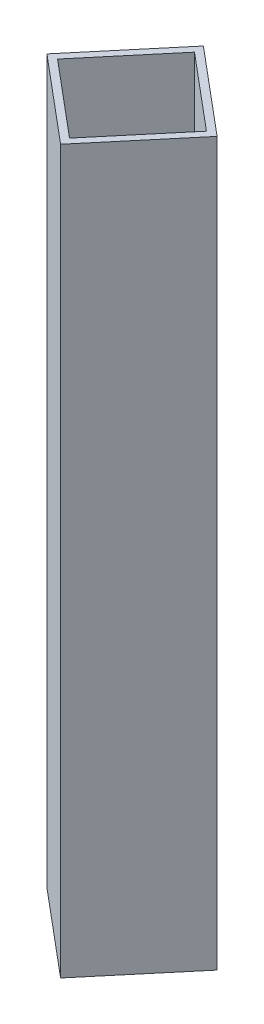
ISO-10303-21;
HEADER;
FILE_DESCRIPTION(('STEP AP214'),'2;1');
FILE_NAME('part.step','',(''),(''),'','','');
FILE_SCHEMA(('AUTOMOTIVE_DESIGN { 1 0 10303 214 1 1 1 1 }'));
ENDSEC;
DATA;
#1=APPLICATION_CONTEXT('core data for automotive mechanical design processes');
#2=APPLICATION_PROTOCOL_DEFINITION('international standard','automotive_design',2000,#1);
#3=PRODUCT_CONTEXT('',#1,'mechanical');
#4=PRODUCT('Part','Part','',(#3));
#5=PRODUCT_RELATED_PRODUCT_CATEGORY('part','',(#4));
#6=PRODUCT_DEFINITION_FORMATION('','',#4);
#7=PRODUCT_DEFINITION_CONTEXT('part definition',#1,'design');
#8=PRODUCT_DEFINITION('design','',#6,#7);
#9=PRODUCT_DEFINITION_SHAPE('','',#8);
#10=(LENGTH_UNIT() NAMED_UNIT(*) SI_UNIT(.MILLI.,.METRE.));
#11=(NAMED_UNIT(*) PLANE_ANGLE_UNIT() SI_UNIT($,.RADIAN.));
#12=(NAMED_UNIT(*) SI_UNIT($,.STERADIAN.) SOLID_ANGLE_UNIT());
#13=UNCERTAINTY_MEASURE_WITH_UNIT(LENGTH_MEASURE(1.E-05),#10,'distance_accuracy_value','');
#14=(GEOMETRIC_REPRESENTATION_CONTEXT(3) GLOBAL_UNCERTAINTY_ASSIGNED_CONTEXT((#13)) GLOBAL_UNIT_ASSIGNED_CONTEXT((#10,
#11,#12)) REPRESENTATION_CONTEXT('',''));
#15=CARTESIAN_POINT('',(0.,0.,0.));
#16=DIRECTION('',(0.,0.,1.));
#17=DIRECTION('',(1.,0.,0.));
#18=AXIS2_PLACEMENT_3D('',#15,#16,#17);
#19=CARTESIAN_POINT('',(278.112903575089,165.1,293.109429165724));
#20=DIRECTION('',(-0.64278760968654,0.,0.766044443118978));
#21=DIRECTION('',(0.766044443118978,0.,0.64278760968654));
#22=AXIS2_PLACEMENT_3D('',#19,#20,#21);
#23=PLANE('',#22);
#24=DIRECTION('',(-0.766044443118978,0.,-0.64278760968654));
#25=VECTOR('',#24,1.);
#26=CARTESIAN_POINT('',(278.112903575089,-165.1,293.109429165724));
#27=LINE('',#26,#25);
#28=CARTESIAN_POINT('',(433.512024242808,-165.1,423.504774003282));
#29=VERTEX_POINT('',#28);
#30=CARTESIAN_POINT('',(394.596966532365,-165.1,390.851163431206));
#31=VERTEX_POINT('',#30);
#32=EDGE_CURVE('E156',#29,#31,#27,.T.);
#33=ORIENTED_EDGE('',*,*,#32,.F.);
#34=DIRECTION('',(0.,-1.,0.));
#35=VECTOR('',#34,1.);
#36=CARTESIAN_POINT('',(433.512024242808,165.1,423.504774003282));
#37=LINE('',#36,#35);
#38=CARTESIAN_POINT('',(433.512024242808,165.1,423.504774003282));
#39=VERTEX_POINT('',#38);
#40=EDGE_CURVE('E9',#39,#29,#37,.T.);
#41=ORIENTED_EDGE('',*,*,#40,.F.);
#42=DIRECTION('',(-0.766044443118978,0.,-0.64278760968654));
#43=VECTOR('',#42,1.);
#44=CARTESIAN_POINT('',(278.112903575089,165.1,293.109429165724));
#45=LINE('',#44,#43);
#46=CARTESIAN_POINT('',(394.596966532365,165.1,390.851163431206));
#47=VERTEX_POINT('',#46);
#48=EDGE_CURVE('E116',#39,#47,#45,.T.);
#49=ORIENTED_EDGE('',*,*,#48,.T.);
#50=DIRECTION('',(0.,-1.,0.));
#51=VECTOR('',#50,1.);
#52=CARTESIAN_POINT('',(394.596966532365,165.1,390.851163431206));
#53=LINE('',#52,#51);
#54=EDGE_CURVE('E83',#47,#31,#53,.T.);
#55=ORIENTED_EDGE('',*,*,#54,.T.);
#56=EDGE_LOOP('',(#33,#41,#49,#55));
#57=FACE_BOUND('',#56,.T.);
#58=ADVANCED_FACE('F14',(#57),#23,.T.);
#59=CARTESIAN_POINT('',(444.568371127719,165.1,410.328332882224));
#60=DIRECTION('',(-0.766044443118978,0.,-0.64278760968654));
#61=DIRECTION('',(-0.64278760968654,0.,0.766044443118978));
#62=AXIS2_PLACEMENT_3D('',#59,#60,#61);
#63=PLANE('',#62);
#64=DIRECTION('',(0.64278760968654,0.,-0.766044443118978));
#65=VECTOR('',#64,1.);
#66=CARTESIAN_POINT('',(444.568371127719,-165.1,410.328332882224));
#67=LINE('',#66,#65);
#68=CARTESIAN_POINT('',(466.165634814885,-165.1,384.589716292838));
#69=VERTEX_POINT('',#68);
#70=EDGE_CURVE('E123',#29,#69,#67,.T.);
#71=ORIENTED_EDGE('',*,*,#70,.T.);
#72=DIRECTION('',(0.,-1.,0.));
#73=VECTOR('',#72,1.);
#74=CARTESIAN_POINT('',(466.165634814885,165.1,384.589716292838));
#75=LINE('',#74,#73);
#76=CARTESIAN_POINT('',(466.165634814885,165.1,384.589716292838));
#77=VERTEX_POINT('',#76);
#78=EDGE_CURVE('E25',#77,#69,#75,.T.);
#79=ORIENTED_EDGE('',*,*,#78,.F.);
#80=DIRECTION('',(0.64278760968654,0.,-0.766044443118978));
#81=VECTOR('',#80,1.);
#82=CARTESIAN_POINT('',(444.568371127719,165.1,410.328332882224));
#83=LINE('',#82,#81);
#84=EDGE_CURVE('E111',#39,#77,#83,.T.);
#85=ORIENTED_EDGE('',*,*,#84,.F.);
#86=ORIENTED_EDGE('',*,*,#40,.T.);
#87=EDGE_LOOP('',(#71,#79,#85,#86));
#88=FACE_BOUND('',#87,.T.);
#89=ADVANCED_FACE('F121',(#88),#63,.F.);
#90=CARTESIAN_POINT('',(360.587988116179,165.1,295.999551887389));
#91=DIRECTION('',(0.64278760968654,0.,-0.766044443118978));
#92=DIRECTION('',(-0.766044443118978,0.,-0.64278760968654));
#93=AXIS2_PLACEMENT_3D('',#90,#91,#92);
#94=PLANE('',#93);
#95=DIRECTION('',(0.766044443118978,0.,0.64278760968654));
#96=VECTOR('',#95,1.);
#97=CARTESIAN_POINT('',(360.587988116179,-165.1,295.999551887389));
#98=LINE('',#97,#96);
#99=CARTESIAN_POINT('',(427.250577104441,-165.1,351.936105720762));
#100=VERTEX_POINT('',#99);
#101=EDGE_CURVE('E162',#100,#69,#98,.T.);
#102=ORIENTED_EDGE('',*,*,#101,.F.);
#103=DIRECTION('',(0.,-1.,0.));
#104=VECTOR('',#103,1.);
#105=CARTESIAN_POINT('',(427.250577104441,165.1,351.936105720762));
#106=LINE('',#105,#104);
#107=CARTESIAN_POINT('',(427.250577104441,165.1,351.936105720762));
#108=VERTEX_POINT('',#107);
#109=EDGE_CURVE('E74',#108,#100,#106,.T.);
#110=ORIENTED_EDGE('',*,*,#109,.F.);
#111=DIRECTION('',(0.766044443118978,0.,0.64278760968654));
#112=VECTOR('',#111,1.);
#113=CARTESIAN_POINT('',(360.587988116179,165.1,295.999551887389));
#114=LINE('',#113,#112);
#115=EDGE_CURVE('E115',#108,#77,#114,.T.);
#116=ORIENTED_EDGE('',*,*,#115,.T.);
#117=ORIENTED_EDGE('',*,*,#78,.T.);
#118=EDGE_LOOP('',(#102,#110,#116,#117));
#119=FACE_BOUND('',#118,.T.);
#120=ADVANCED_FACE('F129',(#119),#94,.T.);
#121=CARTESIAN_POINT('',(442.136180020816,165.1,408.287482221469));
#122=DIRECTION('',(-0.766044443118978,0.,-0.64278760968654));
#123=DIRECTION('',(-0.64278760968654,0.,0.766044443118978));
#124=AXIS2_PLACEMENT_3D('',#121,#122,#123);
#125=PLANE('',#124);
#126=DIRECTION('',(0.64278760968654,0.,-0.766044443118978));
#127=VECTOR('',#126,1.);
#128=CARTESIAN_POINT('',(442.136180020816,-165.1,408.287482221469));
#129=LINE('',#128,#127);
#130=CARTESIAN_POINT('',(433.120683796661,-165.1,419.031732235625));
#131=VERTEX_POINT('',#130);
#132=CARTESIAN_POINT('',(461.692593047227,-165.1,384.981056738986));
#133=VERTEX_POINT('',#132);
#134=EDGE_CURVE('E140',#131,#133,#129,.T.);
#135=ORIENTED_EDGE('',*,*,#134,.F.);
#136=DIRECTION('',(0.,-1.,0.));
#137=VECTOR('',#136,1.);
#138=CARTESIAN_POINT('',(433.120683796661,165.1,419.031732235625));
#139=LINE('',#138,#137);
#140=CARTESIAN_POINT('',(433.120683796661,165.1,419.031732235625));
#141=VERTEX_POINT('',#140);
#142=EDGE_CURVE('E18',#141,#131,#139,.T.);
#143=ORIENTED_EDGE('',*,*,#142,.F.);
#144=DIRECTION('',(0.64278760968654,0.,-0.766044443118978));
#145=VECTOR('',#144,1.);
#146=CARTESIAN_POINT('',(442.136180020816,165.1,408.287482221469));
#147=LINE('',#146,#145);
#148=CARTESIAN_POINT('',(461.692593047227,165.1,384.981056738986));
#149=VERTEX_POINT('',#148);
#150=EDGE_CURVE('E166',#141,#149,#147,.T.);
#151=ORIENTED_EDGE('',*,*,#150,.T.);
#152=DIRECTION('',(0.,-1.,0.));
#153=VECTOR('',#152,1.);
#154=CARTESIAN_POINT('',(461.692593047227,165.1,384.981056738986));
#155=LINE('',#154,#153);
#156=EDGE_CURVE('E136',#149,#133,#155,.T.);
#157=ORIENTED_EDGE('',*,*,#156,.T.);
#158=EDGE_LOOP('',(#135,#143,#151,#157));
#159=FACE_BOUND('',#158,.T.);
#160=ADVANCED_FACE('F16',(#159),#125,.T.);
#161=CARTESIAN_POINT('',(653.412206777253,165.1,603.878267920121));
#162=DIRECTION('',(0.64278760968654,0.,-0.766044443118978));
#163=DIRECTION('',(-0.766044443118978,0.,-0.64278760968654));
#164=AXIS2_PLACEMENT_3D('',#161,#162,#163);
#165=PLANE('',#164);
#166=DIRECTION('',(0.766044443118978,0.,0.64278760968654));
#167=VECTOR('',#166,1.);
#168=CARTESIAN_POINT('',(653.412206777253,-165.1,603.878267920121));
#169=LINE('',#168,#167);
#170=CARTESIAN_POINT('',(399.070008300022,-165.1,390.459822985058));
#171=VERTEX_POINT('',#170);
#172=EDGE_CURVE('E144',#171,#131,#169,.T.);
#173=ORIENTED_EDGE('',*,*,#172,.F.);
#174=DIRECTION('',(0.,-1.,0.));
#175=VECTOR('',#174,1.);
#176=CARTESIAN_POINT('',(399.070008300022,165.1,390.459822985058));
#177=LINE('',#176,#175);
#178=CARTESIAN_POINT('',(399.070008300022,165.1,390.459822985058));
#179=VERTEX_POINT('',#178);
#180=EDGE_CURVE('E175',#179,#171,#177,.T.);
#181=ORIENTED_EDGE('',*,*,#180,.F.);
#182=DIRECTION('',(0.766044443118978,0.,0.64278760968654));
#183=VECTOR('',#182,1.);
#184=CARTESIAN_POINT('',(653.412206777253,165.1,603.878267920121));
#185=LINE('',#184,#183);
#186=EDGE_CURVE('E188',#179,#141,#185,.T.);
#187=ORIENTED_EDGE('',*,*,#186,.T.);
#188=ORIENTED_EDGE('',*,*,#142,.T.);
#189=EDGE_LOOP('',(#173,#181,#187,#188));
#190=FACE_BOUND('',#189,.T.);
#191=ADVANCED_FACE('F186',(#190),#165,.T.);
#192=CARTESIAN_POINT('',(413.355962925306,165.1,373.434485236739));
#193=DIRECTION('',(0.766044443118978,0.,0.64278760968654));
#194=DIRECTION('',(0.64278760968654,0.,-0.766044443118978));
#195=AXIS2_PLACEMENT_3D('',#192,#193,#194);
#196=PLANE('',#195);
#197=DIRECTION('',(-0.64278760968654,0.,0.766044443118978));
#198=VECTOR('',#197,1.);
#199=CARTESIAN_POINT('',(413.355962925306,-165.1,373.434485236739));
#200=LINE('',#199,#198);
#201=CARTESIAN_POINT('',(427.641917550589,-165.1,356.40914748842));
#202=VERTEX_POINT('',#201);
#203=EDGE_CURVE('E148',#202,#171,#200,.T.);
#204=ORIENTED_EDGE('',*,*,#203,.F.);
#205=DIRECTION('',(0.,-1.,0.));
#206=VECTOR('',#205,1.);
#207=CARTESIAN_POINT('',(427.641917550589,165.1,356.40914748842));
#208=LINE('',#207,#206);
#209=CARTESIAN_POINT('',(427.641917550589,165.1,356.40914748842));
#210=VERTEX_POINT('',#209);
#211=EDGE_CURVE('E173',#210,#202,#208,.T.);
#212=ORIENTED_EDGE('',*,*,#211,.F.);
#213=DIRECTION('',(-0.64278760968654,0.,0.766044443118978));
#214=VECTOR('',#213,1.);
#215=CARTESIAN_POINT('',(413.355962925306,165.1,373.434485236739));
#216=LINE('',#215,#214);
#217=EDGE_CURVE('E195',#210,#179,#216,.T.);
#218=ORIENTED_EDGE('',*,*,#217,.T.);
#219=ORIENTED_EDGE('',*,*,#180,.T.);
#220=EDGE_LOOP('',(#204,#212,#218,#219));
#221=FACE_BOUND('',#220,.T.);
#222=ADVANCED_FACE('F193',(#221),#196,.T.);
#223=CARTESIAN_POINT('',(683.020069785306,165.1,570.696860839306));
#224=DIRECTION('',(-0.64278760968654,0.,0.766044443118978));
#225=DIRECTION('',(0.766044443118978,0.,0.64278760968654));
#226=AXIS2_PLACEMENT_3D('',#223,#224,#225);
#227=PLANE('',#226);
#228=DIRECTION('',(-0.766044443118978,0.,-0.64278760968654));
#229=VECTOR('',#228,1.);
#230=CARTESIAN_POINT('',(683.020069785306,-165.1,570.696860839306));
#231=LINE('',#230,#229);
#232=EDGE_CURVE('E152',#133,#202,#231,.T.);
#233=ORIENTED_EDGE('',*,*,#232,.F.);
#234=ORIENTED_EDGE('',*,*,#156,.F.);
#235=DIRECTION('',(-0.766044443118978,0.,-0.64278760968654));
#236=VECTOR('',#235,1.);
#237=CARTESIAN_POINT('',(683.020069785306,165.1,570.696860839306));
#238=LINE('',#237,#236);
#239=EDGE_CURVE('E200',#149,#210,#238,.T.);
#240=ORIENTED_EDGE('',*,*,#239,.T.);
#241=ORIENTED_EDGE('',*,*,#211,.T.);
#242=EDGE_LOOP('',(#233,#234,#240,#241));
#243=FACE_BOUND('',#242,.T.);
#244=ADVANCED_FACE('F203',(#243),#227,.T.);
#245=CARTESIAN_POINT('',(410.923771818402,165.1,371.393634575984));
#246=DIRECTION('',(0.766044443118978,0.,0.64278760968654));
#247=DIRECTION('',(0.64278760968654,0.,-0.766044443118978));
#248=AXIS2_PLACEMENT_3D('',#245,#246,#247);
#249=PLANE('',#248);
#250=DIRECTION('',(-0.64278760968654,0.,0.766044443118978));
#251=VECTOR('',#250,1.);
#252=CARTESIAN_POINT('',(410.923771818402,-165.1,371.393634575984));
#253=LINE('',#252,#251);
#254=EDGE_CURVE('E164',#100,#31,#253,.T.);
#255=ORIENTED_EDGE('',*,*,#254,.T.);
#256=ORIENTED_EDGE('',*,*,#54,.F.);
#257=DIRECTION('',(-0.64278760968654,0.,0.766044443118978));
#258=VECTOR('',#257,1.);
#259=CARTESIAN_POINT('',(410.923771818402,165.1,371.393634575984));
#260=LINE('',#259,#258);
#261=EDGE_CURVE('E39',#108,#47,#260,.T.);
#262=ORIENTED_EDGE('',*,*,#261,.F.);
#263=ORIENTED_EDGE('',*,*,#109,.T.);
#264=EDGE_LOOP('',(#255,#256,#262,#263));
#265=FACE_BOUND('',#264,.T.);
#266=ADVANCED_FACE('F240',(#265),#249,.F.);
#267=CARTESIAN_POINT('',(705.053366952356,165.1,637.655198226429));
#268=DIRECTION('',(0.,1.,0.));
#269=DIRECTION('',(-1.,0.,0.));
#270=AXIS2_PLACEMENT_3D('',#267,#268,#269);
#271=PLANE('',#270);
#272=ORIENTED_EDGE('',*,*,#150,.F.);
#273=ORIENTED_EDGE('',*,*,#186,.F.);
#274=ORIENTED_EDGE('',*,*,#217,.F.);
#275=ORIENTED_EDGE('',*,*,#239,.F.);
#276=EDGE_LOOP('',(#272,#273,#274,#275));
#277=FACE_BOUND('',#276,.T.);
#278=ORIENTED_EDGE('',*,*,#48,.F.);
#279=ORIENTED_EDGE('',*,*,#84,.T.);
#280=ORIENTED_EDGE('',*,*,#115,.F.);
#281=ORIENTED_EDGE('',*,*,#261,.T.);
#282=EDGE_LOOP('',(#278,#279,#280,#281));
#283=FACE_BOUND('',#282,.T.);
#284=ADVANCED_FACE('F113',(#277,#283),#271,.T.);
#285=CARTESIAN_POINT('',(705.053366952356,-165.1,637.655198226429));
#286=DIRECTION('',(0.,1.,0.));
#287=DIRECTION('',(-1.,0.,0.));
#288=AXIS2_PLACEMENT_3D('',#285,#286,#287);
#289=PLANE('',#288);
#290=ORIENTED_EDGE('',*,*,#134,.T.);
#291=ORIENTED_EDGE('',*,*,#232,.T.);
#292=ORIENTED_EDGE('',*,*,#203,.T.);
#293=ORIENTED_EDGE('',*,*,#172,.T.);
#294=EDGE_LOOP('',(#290,#291,#292,#293));
#295=FACE_BOUND('',#294,.T.);
#296=ORIENTED_EDGE('',*,*,#32,.T.);
#297=ORIENTED_EDGE('',*,*,#254,.F.);
#298=ORIENTED_EDGE('',*,*,#101,.T.);
#299=ORIENTED_EDGE('',*,*,#70,.F.);
#300=EDGE_LOOP('',(#296,#297,#298,#299));
#301=FACE_BOUND('',#300,.T.);
#302=ADVANCED_FACE('F191',(#295,#301),#289,.F.);
#303=CLOSED_SHELL('',(#58,#89,#120,#160,#191,#222,#244,#266,#284,#302));
#304=MANIFOLD_SOLID_BREP('B1',#303);
#305=ADVANCED_BREP_SHAPE_REPRESENTATION('',(#18,#304),#14);
#306=SHAPE_DEFINITION_REPRESENTATION(#9,#305);
ENDSEC;
END-ISO-10303-21;
